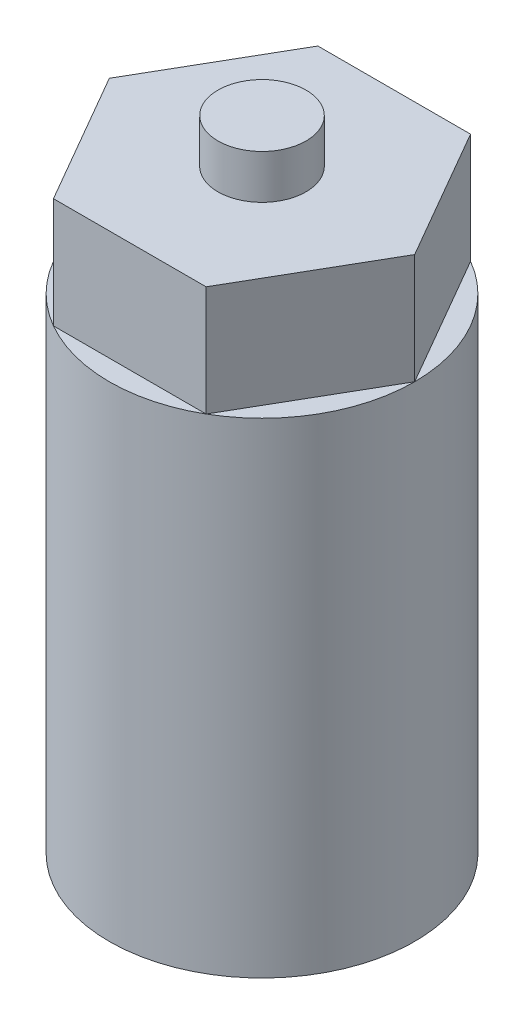
ISO-10303-21;
HEADER;
FILE_DESCRIPTION(('STEP AP214'),'2;1');
FILE_NAME('part.step','',(''),(''),'','','');
FILE_SCHEMA(('AUTOMOTIVE_DESIGN { 1 0 10303 214 1 1 1 1 }'));
ENDSEC;
DATA;
#1=APPLICATION_CONTEXT('core data for automotive mechanical design processes');
#2=APPLICATION_PROTOCOL_DEFINITION('international standard','automotive_design',2000,#1);
#3=PRODUCT_CONTEXT('',#1,'mechanical');
#4=PRODUCT('Part','Part','',(#3));
#5=PRODUCT_RELATED_PRODUCT_CATEGORY('part','',(#4));
#6=PRODUCT_DEFINITION_FORMATION('','',#4);
#7=PRODUCT_DEFINITION_CONTEXT('part definition',#1,'design');
#8=PRODUCT_DEFINITION('design','',#6,#7);
#9=PRODUCT_DEFINITION_SHAPE('','',#8);
#10=(LENGTH_UNIT() NAMED_UNIT(*) SI_UNIT(.MILLI.,.METRE.));
#11=(NAMED_UNIT(*) PLANE_ANGLE_UNIT() SI_UNIT($,.RADIAN.));
#12=(NAMED_UNIT(*) SI_UNIT($,.STERADIAN.) SOLID_ANGLE_UNIT());
#13=UNCERTAINTY_MEASURE_WITH_UNIT(LENGTH_MEASURE(1.E-05),#10,'distance_accuracy_value','');
#14=(GEOMETRIC_REPRESENTATION_CONTEXT(3) GLOBAL_UNCERTAINTY_ASSIGNED_CONTEXT((#13)) GLOBAL_UNIT_ASSIGNED_CONTEXT((#10,
#11,#12)) REPRESENTATION_CONTEXT('',''));
#15=CARTESIAN_POINT('',(0.,0.,0.));
#16=DIRECTION('',(0.,0.,1.));
#17=DIRECTION('',(1.,0.,0.));
#18=AXIS2_PLACEMENT_3D('',#15,#16,#17);
#19=CARTESIAN_POINT('',(-5.19615242270718,5.,-3.00000000000025));
#20=DIRECTION('',(0.866025403784444,0.,0.499999999999992));
#21=DIRECTION('',(0.499999999999992,0.,-0.866025403784444));
#22=AXIS2_PLACEMENT_3D('',#19,#20,#21);
#23=PLANE('',#22);
#24=DIRECTION('',(-0.499999999999992,0.,0.866025403784444));
#25=VECTOR('',#24,1.);
#26=CARTESIAN_POINT('',(-5.19615242270718,0.,-3.00000000000025));
#27=LINE('',#26,#25);
#28=CARTESIAN_POINT('',(-3.46410161513893,0.,-5.99999999999922));
#29=VERTEX_POINT('',#28);
#30=CARTESIAN_POINT('',(-6.92820323027542,0.,-1.26764918007005E-12));
#31=VERTEX_POINT('',#30);
#32=EDGE_CURVE('E88',#29,#31,#27,.T.);
#33=ORIENTED_EDGE('',*,*,#32,.T.);
#34=DIRECTION('',(0.,-1.,0.));
#35=VECTOR('',#34,1.);
#36=CARTESIAN_POINT('',(-6.92820323027542,5.,-1.27025126528402E-12));
#37=LINE('',#36,#35);
#38=CARTESIAN_POINT('',(-6.92820323027542,5.,-1.27025126528402E-12));
#39=VERTEX_POINT('',#38);
#40=EDGE_CURVE('E11',#39,#31,#37,.T.);
#41=ORIENTED_EDGE('',*,*,#40,.F.);
#42=DIRECTION('',(-0.499999999999992,0.,0.866025403784444));
#43=VECTOR('',#42,1.);
#44=CARTESIAN_POINT('',(-5.19615242270718,5.,-3.00000000000025));
#45=LINE('',#44,#43);
#46=CARTESIAN_POINT('',(-3.46410161513775,5.,-6.00000000000127));
#47=VERTEX_POINT('',#46);
#48=EDGE_CURVE('E146',#47,#39,#45,.T.);
#49=ORIENTED_EDGE('',*,*,#48,.F.);
#50=DIRECTION('',(0.,-1.,0.));
#51=VECTOR('',#50,1.);
#52=CARTESIAN_POINT('',(-3.46410161513775,5.,-6.00000000000127));
#53=LINE('',#52,#51);
#54=EDGE_CURVE('E128',#47,#29,#53,.T.);
#55=ORIENTED_EDGE('',*,*,#54,.T.);
#56=EDGE_LOOP('',(#33,#41,#49,#55));
#57=FACE_BOUND('',#56,.T.);
#58=ADVANCED_FACE('F41',(#57),#23,.F.);
#59=CARTESIAN_POINT('',(-5.19615242270608,5.,2.99999999999961));
#60=DIRECTION('',(0.866025403784444,0.,-0.499999999999991));
#61=DIRECTION('',(-0.499999999999991,0.,-0.866025403784444));
#62=AXIS2_PLACEMENT_3D('',#59,#60,#61);
#63=PLANE('',#62);
#64=DIRECTION('',(0.499999999999991,0.,0.866025403784444));
#65=VECTOR('',#64,1.);
#66=CARTESIAN_POINT('',(-5.19615242270608,0.,2.99999999999961));
#67=LINE('',#66,#65);
#68=CARTESIAN_POINT('',(-3.46410161513775,0.,5.99999999999873));
#69=VERTEX_POINT('',#68);
#70=EDGE_CURVE('E133',#31,#69,#67,.T.);
#71=ORIENTED_EDGE('',*,*,#70,.T.);
#72=DIRECTION('',(0.,-1.,0.));
#73=VECTOR('',#72,1.);
#74=CARTESIAN_POINT('',(-3.46410161513775,5.,5.99999999999873));
#75=LINE('',#74,#73);
#76=CARTESIAN_POINT('',(-3.46410161513775,5.,5.99999999999873));
#77=VERTEX_POINT('',#76);
#78=EDGE_CURVE('E48',#77,#69,#75,.T.);
#79=ORIENTED_EDGE('',*,*,#78,.F.);
#80=DIRECTION('',(0.499999999999991,0.,0.866025403784444));
#81=VECTOR('',#80,1.);
#82=CARTESIAN_POINT('',(-5.19615242270608,5.,2.99999999999961));
#83=LINE('',#82,#81);
#84=EDGE_CURVE('E157',#39,#77,#83,.T.);
#85=ORIENTED_EDGE('',*,*,#84,.F.);
#86=ORIENTED_EDGE('',*,*,#40,.T.);
#87=EDGE_LOOP('',(#71,#79,#85,#86));
#88=FACE_BOUND('',#87,.T.);
#89=ADVANCED_FACE('F156',(#88),#63,.F.);
#90=CARTESIAN_POINT('',(0.,5.,5.99999999999874));
#91=DIRECTION('',(0.,0.,-1.));
#92=DIRECTION('',(-1.,0.,0.));
#93=AXIS2_PLACEMENT_3D('',#90,#91,#92);
#94=PLANE('',#93);
#95=DIRECTION('',(1.,0.,0.));
#96=VECTOR('',#95,1.);
#97=CARTESIAN_POINT('',(0.,0.,5.99999999999874));
#98=LINE('',#97,#96);
#99=CARTESIAN_POINT('',(3.46410161513977,0.,5.99999999999874));
#100=VERTEX_POINT('',#99);
#101=EDGE_CURVE('E137',#69,#100,#98,.T.);
#102=ORIENTED_EDGE('',*,*,#101,.T.);
#103=DIRECTION('',(0.,-1.,0.));
#104=VECTOR('',#103,1.);
#105=CARTESIAN_POINT('',(3.46410161513772,5.,5.99999999999874));
#106=LINE('',#105,#104);
#107=CARTESIAN_POINT('',(3.46410161513772,5.,5.99999999999874));
#108=VERTEX_POINT('',#107);
#109=EDGE_CURVE('E122',#108,#100,#106,.T.);
#110=ORIENTED_EDGE('',*,*,#109,.F.);
#111=DIRECTION('',(1.,0.,0.));
#112=VECTOR('',#111,1.);
#113=CARTESIAN_POINT('',(0.,5.,5.99999999999874));
#114=LINE('',#113,#112);
#115=EDGE_CURVE('E108',#77,#108,#114,.T.);
#116=ORIENTED_EDGE('',*,*,#115,.F.);
#117=ORIENTED_EDGE('',*,*,#78,.T.);
#118=EDGE_LOOP('',(#102,#110,#116,#117));
#119=FACE_BOUND('',#118,.T.);
#120=ADVANCED_FACE('F153',(#119),#94,.F.);
#121=CARTESIAN_POINT('',(5.19615242270606,5.,2.9999999999996));
#122=DIRECTION('',(-0.866025403784444,0.,-0.499999999999991));
#123=DIRECTION('',(-0.499999999999991,0.,0.866025403784444));
#124=AXIS2_PLACEMENT_3D('',#121,#122,#123);
#125=PLANE('',#124);
#126=DIRECTION('',(0.499999999999991,0.,-0.866025403784444));
#127=VECTOR('',#126,1.);
#128=CARTESIAN_POINT('',(5.19615242270606,0.,2.9999999999996));
#129=LINE('',#128,#127);
#130=CARTESIAN_POINT('',(6.92820323027542,0.,-1.26678181833207E-12));
#131=VERTEX_POINT('',#130);
#132=EDGE_CURVE('E119',#100,#131,#129,.T.);
#133=ORIENTED_EDGE('',*,*,#132,.T.);
#134=DIRECTION('',(0.,-1.,0.));
#135=VECTOR('',#134,1.);
#136=CARTESIAN_POINT('',(6.9282032302754,5.,-1.26678181833206E-12));
#137=LINE('',#136,#135);
#138=CARTESIAN_POINT('',(6.9282032302754,5.,-1.26678181833206E-12));
#139=VERTEX_POINT('',#138);
#140=EDGE_CURVE('E115',#139,#131,#137,.T.);
#141=ORIENTED_EDGE('',*,*,#140,.F.);
#142=DIRECTION('',(0.499999999999991,0.,-0.866025403784444));
#143=VECTOR('',#142,1.);
#144=CARTESIAN_POINT('',(5.19615242270606,5.,2.9999999999996));
#145=LINE('',#144,#143);
#146=EDGE_CURVE('E101',#108,#139,#145,.T.);
#147=ORIENTED_EDGE('',*,*,#146,.F.);
#148=ORIENTED_EDGE('',*,*,#109,.T.);
#149=EDGE_LOOP('',(#133,#141,#147,#148));
#150=FACE_BOUND('',#149,.T.);
#151=ADVANCED_FACE('F116',(#150),#125,.F.);
#152=CARTESIAN_POINT('',(5.19615242270716,5.,-3.00000000000023));
#153=DIRECTION('',(-0.866025403784444,0.,0.499999999999991));
#154=DIRECTION('',(0.499999999999991,0.,0.866025403784444));
#155=AXIS2_PLACEMENT_3D('',#152,#153,#154);
#156=PLANE('',#155);
#157=DIRECTION('',(-0.499999999999991,0.,-0.866025403784444));
#158=VECTOR('',#157,1.);
#159=CARTESIAN_POINT('',(5.19615242270716,0.,-3.00000000000023));
#160=LINE('',#159,#158);
#161=CARTESIAN_POINT('',(3.46410161513538,0.,-6.00000000000127));
#162=VERTEX_POINT('',#161);
#163=EDGE_CURVE('E141',#131,#162,#160,.T.);
#164=ORIENTED_EDGE('',*,*,#163,.T.);
#165=DIRECTION('',(0.,-1.,0.));
#166=VECTOR('',#165,1.);
#167=CARTESIAN_POINT('',(3.46410161513772,5.,-6.00000000000127));
#168=LINE('',#167,#166);
#169=CARTESIAN_POINT('',(3.46410161513772,5.,-6.00000000000127));
#170=VERTEX_POINT('',#169);
#171=EDGE_CURVE('E123',#170,#162,#168,.T.);
#172=ORIENTED_EDGE('',*,*,#171,.F.);
#173=DIRECTION('',(-0.499999999999991,0.,-0.866025403784444));
#174=VECTOR('',#173,1.);
#175=CARTESIAN_POINT('',(5.19615242270716,5.,-3.00000000000023));
#176=LINE('',#175,#174);
#177=EDGE_CURVE('E105',#139,#170,#176,.T.);
#178=ORIENTED_EDGE('',*,*,#177,.F.);
#179=ORIENTED_EDGE('',*,*,#140,.T.);
#180=EDGE_LOOP('',(#164,#172,#178,#179));
#181=FACE_BOUND('',#180,.T.);
#182=ADVANCED_FACE('F125',(#181),#156,.F.);
#183=CARTESIAN_POINT('',(0.,5.,-6.00000000000127));
#184=DIRECTION('',(0.,0.,1.));
#185=DIRECTION('',(1.,0.,0.));
#186=AXIS2_PLACEMENT_3D('',#183,#184,#185);
#187=PLANE('',#186);
#188=DIRECTION('',(-1.,0.,0.));
#189=VECTOR('',#188,1.);
#190=CARTESIAN_POINT('',(0.,0.,-6.00000000000127));
#191=LINE('',#190,#189);
#192=EDGE_CURVE('E143',#162,#29,#191,.T.);
#193=ORIENTED_EDGE('',*,*,#192,.T.);
#194=ORIENTED_EDGE('',*,*,#54,.F.);
#195=DIRECTION('',(-1.,0.,0.));
#196=VECTOR('',#195,1.);
#197=CARTESIAN_POINT('',(0.,5.,-6.00000000000127));
#198=LINE('',#197,#196);
#199=EDGE_CURVE('E64',#170,#47,#198,.T.);
#200=ORIENTED_EDGE('',*,*,#199,.F.);
#201=ORIENTED_EDGE('',*,*,#171,.T.);
#202=EDGE_LOOP('',(#193,#194,#200,#201));
#203=FACE_BOUND('',#202,.T.);
#204=ADVANCED_FACE('F185',(#203),#187,.F.);
#205=CARTESIAN_POINT('',(0.,5.,0.));
#206=DIRECTION('',(0.,1.,0.));
#207=DIRECTION('',(0.,0.,1.));
#208=AXIS2_PLACEMENT_3D('',#205,#206,#207);
#209=PLANE('',#208);
#210=CARTESIAN_POINT('',(0.,5.,0.));
#211=DIRECTION('',(0.,1.,0.));
#212=DIRECTION('',(0.,0.,1.));
#213=AXIS2_PLACEMENT_3D('',#210,#211,#212);
#214=CIRCLE('',#213,2.);
#215=CARTESIAN_POINT('',(0.,5.,2.));
#216=VERTEX_POINT('',#215);
#217=EDGE_CURVE('E134',#216,#216,#214,.F.);
#218=ORIENTED_EDGE('',*,*,#217,.T.);
#219=EDGE_LOOP('',(#218));
#220=FACE_BOUND('',#219,.T.);
#221=ORIENTED_EDGE('',*,*,#48,.T.);
#222=ORIENTED_EDGE('',*,*,#84,.T.);
#223=ORIENTED_EDGE('',*,*,#115,.T.);
#224=ORIENTED_EDGE('',*,*,#146,.T.);
#225=ORIENTED_EDGE('',*,*,#177,.T.);
#226=ORIENTED_EDGE('',*,*,#199,.T.);
#227=EDGE_LOOP('',(#221,#222,#223,#224,#225,#226));
#228=FACE_BOUND('',#227,.T.);
#229=ADVANCED_FACE('F103',(#220,#228),#209,.T.);
#230=CARTESIAN_POINT('',(0.,7.,0.));
#231=DIRECTION('',(0.,-1.,0.));
#232=DIRECTION('',(0.,0.,-1.));
#233=AXIS2_PLACEMENT_3D('',#230,#231,#232);
#234=CYLINDRICAL_SURFACE('',#233,2.);
#235=ORIENTED_EDGE('',*,*,#217,.F.);
#236=EDGE_LOOP('',(#235));
#237=FACE_BOUND('',#236,.T.);
#238=CARTESIAN_POINT('',(0.,7.,0.));
#239=DIRECTION('',(0.,1.,0.));
#240=DIRECTION('',(0.,0.,1.));
#241=AXIS2_PLACEMENT_3D('',#238,#239,#240);
#242=CIRCLE('',#241,2.);
#243=CARTESIAN_POINT('',(0.,7.,2.));
#244=VERTEX_POINT('',#243);
#245=EDGE_CURVE('E176',#244,#244,#242,.T.);
#246=ORIENTED_EDGE('',*,*,#245,.F.);
#247=EDGE_LOOP('',(#246));
#248=FACE_BOUND('',#247,.T.);
#249=ADVANCED_FACE('F255',(#237,#248),#234,.T.);
#250=CARTESIAN_POINT('',(0.,7.,0.));
#251=DIRECTION('',(0.,1.,0.));
#252=DIRECTION('',(0.,0.,1.));
#253=AXIS2_PLACEMENT_3D('',#250,#251,#252);
#254=PLANE('',#253);
#255=ORIENTED_EDGE('',*,*,#245,.T.);
#256=EDGE_LOOP('',(#255));
#257=FACE_BOUND('',#256,.T.);
#258=ADVANCED_FACE('F260',(#257),#254,.T.);
#259=CARTESIAN_POINT('',(0.,0.,0.));
#260=DIRECTION('',(0.,-1.,0.));
#261=DIRECTION('',(0.,0.,-1.));
#262=AXIS2_PLACEMENT_3D('',#259,#260,#261);
#263=PLANE('',#262);
#264=ORIENTED_EDGE('',*,*,#32,.F.);
#265=CARTESIAN_POINT('',(0.,0.,0.));
#266=DIRECTION('',(0.,-1.,0.));
#267=DIRECTION('',(0.,0.,-1.));
#268=AXIS2_PLACEMENT_3D('',#265,#266,#267);
#269=CIRCLE('',#268,6.92820323027542);
#270=EDGE_CURVE('E163',#31,#29,#269,.T.);
#271=ORIENTED_EDGE('',*,*,#270,.F.);
#272=EDGE_LOOP('',(#264,#271));
#273=FACE_BOUND('',#272,.T.);
#274=ADVANCED_FACE('F164',(#273),#263,.F.);
#275=ORIENTED_EDGE('',*,*,#192,.F.);
#276=EDGE_CURVE('E166',#29,#162,#269,.T.);
#277=ORIENTED_EDGE('',*,*,#276,.F.);
#278=EDGE_LOOP('',(#275,#277));
#279=FACE_BOUND('',#278,.T.);
#280=ADVANCED_FACE('F189',(#279),#263,.F.);
#281=ORIENTED_EDGE('',*,*,#163,.F.);
#282=EDGE_CURVE('E171',#162,#131,#269,.T.);
#283=ORIENTED_EDGE('',*,*,#282,.F.);
#284=EDGE_LOOP('',(#281,#283));
#285=FACE_BOUND('',#284,.T.);
#286=ADVANCED_FACE('F196',(#285),#263,.F.);
#287=ORIENTED_EDGE('',*,*,#132,.F.);
#288=EDGE_CURVE('E170',#131,#100,#269,.T.);
#289=ORIENTED_EDGE('',*,*,#288,.F.);
#290=EDGE_LOOP('',(#287,#289));
#291=FACE_BOUND('',#290,.T.);
#292=ADVANCED_FACE('F200',(#291),#263,.F.);
#293=ORIENTED_EDGE('',*,*,#101,.F.);
#294=EDGE_CURVE('E77',#100,#69,#269,.T.);
#295=ORIENTED_EDGE('',*,*,#294,.F.);
#296=EDGE_LOOP('',(#293,#295));
#297=FACE_BOUND('',#296,.T.);
#298=ADVANCED_FACE('F271',(#297),#263,.F.);
#299=CARTESIAN_POINT('',(0.,-22.,0.));
#300=DIRECTION('',(0.,-1.,0.));
#301=DIRECTION('',(0.,0.,-1.));
#302=AXIS2_PLACEMENT_3D('',#299,#300,#301);
#303=PLANE('',#302);
#304=CARTESIAN_POINT('',(0.,-22.,0.));
#305=DIRECTION('',(0.,-1.,0.));
#306=DIRECTION('',(0.,0.,-1.));
#307=AXIS2_PLACEMENT_3D('',#304,#305,#306);
#308=CIRCLE('',#307,6.92820323027542);
#309=CARTESIAN_POINT('',(0.,-22.,-6.92820323027542));
#310=VERTEX_POINT('',#309);
#311=EDGE_CURVE('E174',#310,#310,#308,.T.);
#312=ORIENTED_EDGE('',*,*,#311,.T.);
#313=EDGE_LOOP('',(#312));
#314=FACE_BOUND('',#313,.T.);
#315=DIRECTION('',(-1.,0.,0.));
#316=VECTOR('',#315,1.);
#317=CARTESIAN_POINT('',(-1.79373911146521,-22.,2.65));
#318=LINE('',#317,#316);
#319=CARTESIAN_POINT('',(1.79373911146521,-22.,2.65));
#320=VERTEX_POINT('',#319);
#321=CARTESIAN_POINT('',(-1.79373911146521,-22.,2.65));
#322=VERTEX_POINT('',#321);
#323=EDGE_CURVE('E208',#320,#322,#318,.T.);
#324=ORIENTED_EDGE('',*,*,#323,.F.);
#325=CARTESIAN_POINT('',(0.,-22.,0.));
#326=DIRECTION('',(0.,-1.,0.));
#327=DIRECTION('',(0.,0.,1.));
#328=AXIS2_PLACEMENT_3D('',#325,#326,#327);
#329=CIRCLE('',#328,3.2);
#330=EDGE_CURVE('E214',#322,#320,#329,.T.);
#331=ORIENTED_EDGE('',*,*,#330,.F.);
#332=EDGE_LOOP('',(#324,#331));
#333=FACE_BOUND('',#332,.T.);
#334=ADVANCED_FACE('F222',(#314,#333),#303,.T.);
#335=ORIENTED_EDGE('',*,*,#70,.F.);
#336=EDGE_CURVE('E161',#69,#31,#269,.T.);
#337=ORIENTED_EDGE('',*,*,#336,.F.);
#338=EDGE_LOOP('',(#335,#337));
#339=FACE_BOUND('',#338,.T.);
#340=ADVANCED_FACE('F160',(#339),#263,.F.);
#341=CARTESIAN_POINT('',(0.,-22.,0.));
#342=DIRECTION('',(0.,1.,0.));
#343=DIRECTION('',(0.,0.,1.));
#344=AXIS2_PLACEMENT_3D('',#341,#342,#343);
#345=CYLINDRICAL_SURFACE('',#344,6.92820323027542);
#346=ORIENTED_EDGE('',*,*,#311,.F.);
#347=EDGE_LOOP('',(#346));
#348=FACE_BOUND('',#347,.T.);
#349=ORIENTED_EDGE('',*,*,#282,.T.);
#350=ORIENTED_EDGE('',*,*,#288,.T.);
#351=ORIENTED_EDGE('',*,*,#294,.T.);
#352=ORIENTED_EDGE('',*,*,#336,.T.);
#353=ORIENTED_EDGE('',*,*,#270,.T.);
#354=ORIENTED_EDGE('',*,*,#276,.T.);
#355=EDGE_LOOP('',(#349,#350,#351,#352,#353,#354));
#356=FACE_BOUND('',#355,.T.);
#357=ADVANCED_FACE('F169',(#348,#356),#345,.T.);
#358=CARTESIAN_POINT('',(0.,-22.,0.));
#359=DIRECTION('',(0.,1.,0.));
#360=DIRECTION('',(0.,0.,1.));
#361=AXIS2_PLACEMENT_3D('',#358,#359,#360);
#362=CYLINDRICAL_SURFACE('',#361,3.2);
#363=CARTESIAN_POINT('',(0.,0.,0.));
#364=DIRECTION('',(0.,-1.,0.));
#365=DIRECTION('',(0.,0.,1.));
#366=AXIS2_PLACEMENT_3D('',#363,#364,#365);
#367=CIRCLE('',#366,3.2);
#368=CARTESIAN_POINT('',(-1.79373911146521,0.,2.65));
#369=VERTEX_POINT('',#368);
#370=CARTESIAN_POINT('',(1.79373911146521,0.,2.65));
#371=VERTEX_POINT('',#370);
#372=EDGE_CURVE('E219',#369,#371,#367,.T.);
#373=ORIENTED_EDGE('',*,*,#372,.F.);
#374=DIRECTION('',(0.,1.,0.));
#375=VECTOR('',#374,1.);
#376=CARTESIAN_POINT('',(-1.79373911146521,-22.,2.65));
#377=LINE('',#376,#375);
#378=EDGE_CURVE('E55',#322,#369,#377,.T.);
#379=ORIENTED_EDGE('',*,*,#378,.F.);
#380=ORIENTED_EDGE('',*,*,#330,.T.);
#381=DIRECTION('',(0.,1.,0.));
#382=VECTOR('',#381,1.);
#383=CARTESIAN_POINT('',(1.79373911146521,-22.,2.65));
#384=LINE('',#383,#382);
#385=EDGE_CURVE('E193',#320,#371,#384,.T.);
#386=ORIENTED_EDGE('',*,*,#385,.T.);
#387=EDGE_LOOP('',(#373,#379,#380,#386));
#388=FACE_BOUND('',#387,.T.);
#389=ADVANCED_FACE('F217',(#388),#362,.F.);
#390=CARTESIAN_POINT('',(-1.79373911146521,-22.,2.65));
#391=DIRECTION('',(0.,0.,-1.));
#392=DIRECTION('',(-1.,0.,0.));
#393=AXIS2_PLACEMENT_3D('',#390,#391,#392);
#394=PLANE('',#393);
#395=DIRECTION('',(-1.,0.,0.));
#396=VECTOR('',#395,1.);
#397=CARTESIAN_POINT('',(-1.79373911146521,0.,2.65));
#398=LINE('',#397,#396);
#399=EDGE_CURVE('E223',#371,#369,#398,.T.);
#400=ORIENTED_EDGE('',*,*,#399,.F.);
#401=ORIENTED_EDGE('',*,*,#385,.F.);
#402=ORIENTED_EDGE('',*,*,#323,.T.);
#403=ORIENTED_EDGE('',*,*,#378,.T.);
#404=EDGE_LOOP('',(#400,#401,#402,#403));
#405=FACE_BOUND('',#404,.T.);
#406=ADVANCED_FACE('F209',(#405),#394,.T.);
#407=CARTESIAN_POINT('',(0.,0.,0.));
#408=DIRECTION('',(0.,1.,0.));
#409=DIRECTION('',(0.,0.,1.));
#410=AXIS2_PLACEMENT_3D('',#407,#408,#409);
#411=PLANE('',#410);
#412=ORIENTED_EDGE('',*,*,#399,.T.);
#413=ORIENTED_EDGE('',*,*,#372,.T.);
#414=EDGE_LOOP('',(#412,#413));
#415=FACE_BOUND('',#414,.T.);
#416=ADVANCED_FACE('F228',(#415),#411,.F.);
#417=CLOSED_SHELL('',(#58,#89,#120,#151,#182,#204,#229,#249,#258,#274,#280,#286,#292,#298,#334,
#340,#357,#389,#406,#416));
#418=MANIFOLD_SOLID_BREP('B2',#417);
#419=ADVANCED_BREP_SHAPE_REPRESENTATION('',(#18,#418),#14);
#420=SHAPE_DEFINITION_REPRESENTATION(#9,#419);
ENDSEC;
END-ISO-10303-21;
